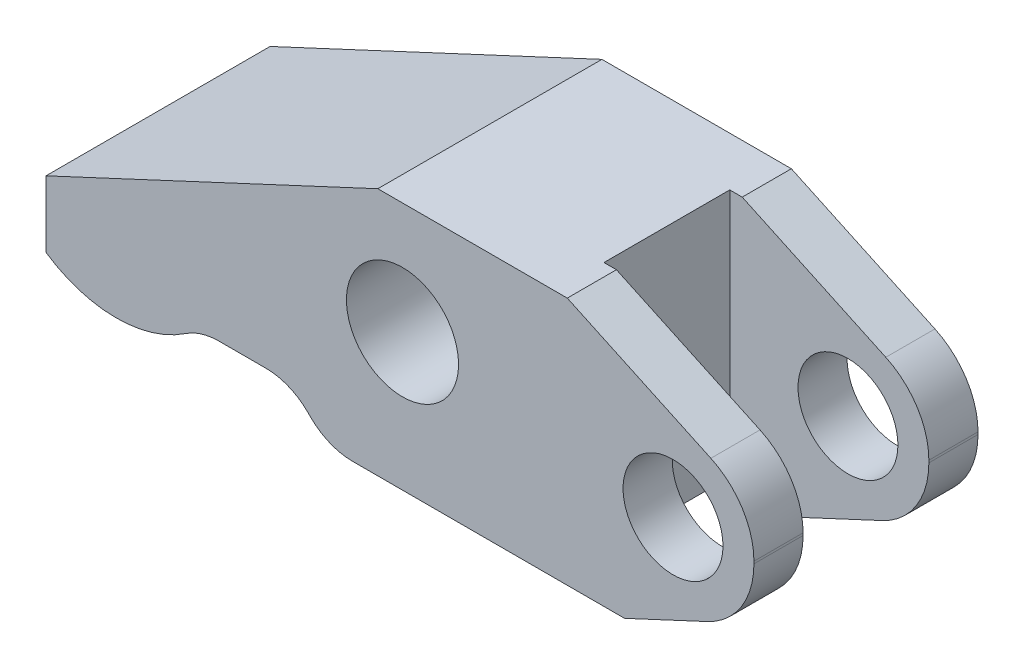
ISO-10303-21;
HEADER;
FILE_DESCRIPTION(('STEP AP214'),'2;1');
FILE_NAME('part.step','',(''),(''),'','','');
FILE_SCHEMA(('AUTOMOTIVE_DESIGN { 1 0 10303 214 1 1 1 1 }'));
ENDSEC;
DATA;
#1=APPLICATION_CONTEXT('core data for automotive mechanical design processes');
#2=APPLICATION_PROTOCOL_DEFINITION('international standard','automotive_design',2000,#1);
#3=PRODUCT_CONTEXT('',#1,'mechanical');
#4=PRODUCT('Part','Part','',(#3));
#5=PRODUCT_RELATED_PRODUCT_CATEGORY('part','',(#4));
#6=PRODUCT_DEFINITION_FORMATION('','',#4);
#7=PRODUCT_DEFINITION_CONTEXT('part definition',#1,'design');
#8=PRODUCT_DEFINITION('design','',#6,#7);
#9=PRODUCT_DEFINITION_SHAPE('','',#8);
#10=(LENGTH_UNIT() NAMED_UNIT(*) SI_UNIT(.MILLI.,.METRE.));
#11=(NAMED_UNIT(*) PLANE_ANGLE_UNIT() SI_UNIT($,.RADIAN.));
#12=(NAMED_UNIT(*) SI_UNIT($,.STERADIAN.) SOLID_ANGLE_UNIT());
#13=UNCERTAINTY_MEASURE_WITH_UNIT(LENGTH_MEASURE(1.E-05),#10,'distance_accuracy_value','');
#14=(GEOMETRIC_REPRESENTATION_CONTEXT(3) GLOBAL_UNCERTAINTY_ASSIGNED_CONTEXT((#13)) GLOBAL_UNIT_ASSIGNED_CONTEXT((#10,
#11,#12)) REPRESENTATION_CONTEXT('',''));
#15=CARTESIAN_POINT('',(0.,0.,0.));
#16=DIRECTION('',(0.,0.,1.));
#17=DIRECTION('',(1.,0.,0.));
#18=AXIS2_PLACEMENT_3D('',#15,#16,#17);
#19=CARTESIAN_POINT('',(28.448,9.9949,-9.0043));
#20=DIRECTION('',(-1.,0.,0.));
#21=DIRECTION('',(0.,0.,1.));
#22=AXIS2_PLACEMENT_3D('',#19,#20,#21);
#23=PLANE('',#22);
#24=DIRECTION('',(0.,0.,1.));
#25=VECTOR('',#24,1.);
#26=CARTESIAN_POINT('',(28.448,-1.0033,-9.0043));
#27=LINE('',#26,#25);
#28=CARTESIAN_POINT('',(28.448,-1.0033,5.0546));
#29=VERTEX_POINT('',#28);
#30=CARTESIAN_POINT('',(28.448,-1.0033,9.0043));
#31=VERTEX_POINT('',#30);
#32=EDGE_CURVE('E313',#29,#31,#27,.T.);
#33=ORIENTED_EDGE('',*,*,#32,.F.);
#34=DIRECTION('',(0.,1.,0.));
#35=VECTOR('',#34,1.);
#36=CARTESIAN_POINT('',(28.448,-9.9949,5.0546));
#37=LINE('',#36,#35);
#38=CARTESIAN_POINT('',(28.448,-0.818554854479687,5.0546));
#39=VERTEX_POINT('',#38);
#40=EDGE_CURVE('E224',#29,#39,#37,.T.);
#41=ORIENTED_EDGE('',*,*,#40,.T.);
#42=DIRECTION('',(0.,0.,1.));
#43=VECTOR('',#42,1.);
#44=CARTESIAN_POINT('',(28.448,-0.818554854479686,-9.0043));
#45=LINE('',#44,#43);
#46=CARTESIAN_POINT('',(28.448,-0.818554854479686,9.0043));
#47=VERTEX_POINT('',#46);
#48=EDGE_CURVE('E309',#39,#47,#45,.T.);
#49=ORIENTED_EDGE('',*,*,#48,.T.);
#50=DIRECTION('',(0.,-1.,0.));
#51=VECTOR('',#50,1.);
#52=CARTESIAN_POINT('',(28.448,9.9949,9.0043));
#53=LINE('',#52,#51);
#54=EDGE_CURVE('E349',#47,#31,#53,.T.);
#55=ORIENTED_EDGE('',*,*,#54,.T.);
#56=EDGE_LOOP('',(#33,#41,#49,#55));
#57=FACE_BOUND('',#56,.T.);
#58=ADVANCED_FACE('F35',(#57),#23,.F.);
#59=CARTESIAN_POINT('',(21.9456,-1.0033,-9.0043));
#60=DIRECTION('',(0.,0.,1.));
#61=DIRECTION('',(1.,0.,0.));
#62=AXIS2_PLACEMENT_3D('',#59,#60,#61);
#63=CYLINDRICAL_SURFACE('',#62,4.01574);
#64=CARTESIAN_POINT('',(21.9456,-1.0033,5.0546));
#65=DIRECTION('',(0.,0.,1.));
#66=DIRECTION('',(1.,0.,0.));
#67=AXIS2_PLACEMENT_3D('',#64,#65,#66);
#68=CIRCLE('',#67,4.01574);
#69=CARTESIAN_POINT('',(25.96134,-1.0033,5.0546));
#70=VERTEX_POINT('',#69);
#71=EDGE_CURVE('E243',#70,#70,#68,.F.);
#72=ORIENTED_EDGE('',*,*,#71,.T.);
#73=EDGE_LOOP('',(#72));
#74=FACE_BOUND('',#73,.T.);
#75=CARTESIAN_POINT('',(21.9456,-1.0033,9.0043));
#76=DIRECTION('',(0.,0.,1.));
#77=DIRECTION('',(1.,0.,0.));
#78=AXIS2_PLACEMENT_3D('',#75,#76,#77);
#79=CIRCLE('',#78,4.01574);
#80=CARTESIAN_POINT('',(25.96134,-1.0033,9.0043));
#81=VERTEX_POINT('',#80);
#82=EDGE_CURVE('E326',#81,#81,#79,.T.);
#83=ORIENTED_EDGE('',*,*,#82,.T.);
#84=EDGE_LOOP('',(#83));
#85=FACE_BOUND('',#84,.T.);
#86=ADVANCED_FACE('F476',(#74,#85),#63,.F.);
#87=CARTESIAN_POINT('',(18.0490407478371,-9.9949,-9.0043));
#88=DIRECTION('',(0.422618261740701,-0.906307787036649,0.));
#89=DIRECTION('',(0.906307787036649,0.422618261740701,0.));
#90=AXIS2_PLACEMENT_3D('',#87,#88,#89);
#91=PLANE('',#90);
#92=DIRECTION('',(-0.906307787036649,-0.422618261740701,0.));
#93=VECTOR('',#92,1.);
#94=CARTESIAN_POINT('',(18.0490407478371,-9.9949,5.0546));
#95=LINE('',#94,#93);
#96=CARTESIAN_POINT('',(24.6936329851427,-6.89647575442711,5.0546));
#97=VERTEX_POINT('',#96);
#98=CARTESIAN_POINT('',(18.0490407478371,-9.9949,5.0546));
#99=VERTEX_POINT('',#98);
#100=EDGE_CURVE('E241',#97,#99,#95,.T.);
#101=ORIENTED_EDGE('',*,*,#100,.F.);
#102=DIRECTION('',(0.,0.,1.));
#103=VECTOR('',#102,1.);
#104=CARTESIAN_POINT('',(24.6936329851427,-6.89647575442711,-9.0043));
#105=LINE('',#104,#103);
#106=CARTESIAN_POINT('',(24.6936329851427,-6.89647575442711,9.0043));
#107=VERTEX_POINT('',#106);
#108=EDGE_CURVE('E317',#97,#107,#105,.T.);
#109=ORIENTED_EDGE('',*,*,#108,.T.);
#110=DIRECTION('',(0.906307787036649,0.422618261740701,0.));
#111=VECTOR('',#110,1.);
#112=CARTESIAN_POINT('',(18.0490407478371,-9.9949,9.0043));
#113=LINE('',#112,#111);
#114=CARTESIAN_POINT('',(18.0490407478371,-9.9949,9.0043));
#115=VERTEX_POINT('',#114);
#116=EDGE_CURVE('E265',#115,#107,#113,.T.);
#117=ORIENTED_EDGE('',*,*,#116,.F.);
#118=DIRECTION('',(0.,0.,1.));
#119=VECTOR('',#118,1.);
#120=CARTESIAN_POINT('',(18.0490407478371,-9.9949,-9.0043));
#121=LINE('',#120,#119);
#122=EDGE_CURVE('E292',#99,#115,#121,.T.);
#123=ORIENTED_EDGE('',*,*,#122,.F.);
#124=EDGE_LOOP('',(#101,#109,#117,#123));
#125=FACE_BOUND('',#124,.T.);
#126=ADVANCED_FACE('F421',(#125),#91,.T.);
#127=CARTESIAN_POINT('',(21.9456,-1.0033,-9.0043));
#128=DIRECTION('',(0.,0.,1.));
#129=DIRECTION('',(1.,0.,0.));
#130=AXIS2_PLACEMENT_3D('',#127,#128,#129);
#131=CYLINDRICAL_SURFACE('',#130,6.5024);
#132=CARTESIAN_POINT('',(21.9456,-1.0033,5.0546));
#133=DIRECTION('',(0.,0.,1.));
#134=DIRECTION('',(1.,0.,0.));
#135=AXIS2_PLACEMENT_3D('',#132,#133,#134);
#136=CIRCLE('',#135,6.5024);
#137=EDGE_CURVE('E239',#29,#97,#136,.F.);
#138=ORIENTED_EDGE('',*,*,#137,.F.);
#139=ORIENTED_EDGE('',*,*,#32,.T.);
#140=CARTESIAN_POINT('',(21.9456,-1.0033,9.0043));
#141=DIRECTION('',(0.,0.,1.));
#142=DIRECTION('',(-1.,0.,0.));
#143=AXIS2_PLACEMENT_3D('',#140,#141,#142);
#144=CIRCLE('',#143,6.5024);
#145=EDGE_CURVE('E268',#107,#31,#144,.T.);
#146=ORIENTED_EDGE('',*,*,#145,.F.);
#147=ORIENTED_EDGE('',*,*,#108,.F.);
#148=EDGE_LOOP('',(#138,#139,#146,#147));
#149=FACE_BOUND('',#148,.T.);
#150=ADVANCED_FACE('F417',(#149),#131,.T.);
#151=CARTESIAN_POINT('',(24.9869429081785,4.61421654413281,-9.0043));
#152=DIRECTION('',(0.4226182617407,0.90630778703665,0.));
#153=DIRECTION('',(-0.90630778703665,0.4226182617407,0.));
#154=AXIS2_PLACEMENT_3D('',#151,#152,#153);
#155=PLANE('',#154);
#156=DIRECTION('',(0.90630778703665,-0.4226182617407,0.));
#157=VECTOR('',#156,1.);
#158=CARTESIAN_POINT('',(24.9869429081785,4.61421654413281,5.0546));
#159=LINE('',#158,#157);
#160=CARTESIAN_POINT('',(13.44803,9.9949,5.0546));
#161=VERTEX_POINT('',#160);
#162=CARTESIAN_POINT('',(24.9869429081785,4.6142165441328,5.0546));
#163=VERTEX_POINT('',#162);
#164=EDGE_CURVE('E237',#161,#163,#159,.T.);
#165=ORIENTED_EDGE('',*,*,#164,.F.);
#166=DIRECTION('',(0.,0.,1.));
#167=VECTOR('',#166,1.);
#168=CARTESIAN_POINT('',(13.44803,9.9949,-9.0043));
#169=LINE('',#168,#167);
#170=CARTESIAN_POINT('',(13.44803,9.9949,9.0043));
#171=VERTEX_POINT('',#170);
#172=EDGE_CURVE('E301',#161,#171,#169,.T.);
#173=ORIENTED_EDGE('',*,*,#172,.T.);
#174=DIRECTION('',(-0.90630778703665,0.4226182617407,0.));
#175=VECTOR('',#174,1.);
#176=CARTESIAN_POINT('',(24.9869429081785,4.61421654413281,9.0043));
#177=LINE('',#176,#175);
#178=CARTESIAN_POINT('',(24.9869429081785,4.6142165441328,9.0043));
#179=VERTEX_POINT('',#178);
#180=EDGE_CURVE('E274',#179,#171,#177,.T.);
#181=ORIENTED_EDGE('',*,*,#180,.F.);
#182=DIRECTION('',(0.,0.,1.));
#183=VECTOR('',#182,1.);
#184=CARTESIAN_POINT('',(24.9869429081785,4.6142165441328,-9.0043));
#185=LINE('',#184,#183);
#186=EDGE_CURVE('E305',#163,#179,#185,.T.);
#187=ORIENTED_EDGE('',*,*,#186,.F.);
#188=EDGE_LOOP('',(#165,#173,#181,#187));
#189=FACE_BOUND('',#188,.T.);
#190=ADVANCED_FACE('F403',(#189),#155,.T.);
#191=CARTESIAN_POINT('',(22.4536,-0.818554854479687,-9.0043));
#192=DIRECTION('',(0.,0.,1.));
#193=DIRECTION('',(1.,0.,0.));
#194=AXIS2_PLACEMENT_3D('',#191,#192,#193);
#195=CYLINDRICAL_SURFACE('',#194,5.9944);
#196=CARTESIAN_POINT('',(22.4536,-0.818554854479687,5.0546));
#197=DIRECTION('',(0.,0.,1.));
#198=DIRECTION('',(1.,0.,0.));
#199=AXIS2_PLACEMENT_3D('',#196,#197,#198);
#200=CIRCLE('',#199,5.9944);
#201=EDGE_CURVE('E12',#163,#39,#200,.F.);
#202=ORIENTED_EDGE('',*,*,#201,.F.);
#203=ORIENTED_EDGE('',*,*,#186,.T.);
#204=CARTESIAN_POINT('',(22.4536,-0.818554854479687,9.0043));
#205=DIRECTION('',(0.,0.,1.));
#206=DIRECTION('',(1.,0.,0.));
#207=AXIS2_PLACEMENT_3D('',#204,#205,#206);
#208=CIRCLE('',#207,5.9944);
#209=EDGE_CURVE('E271',#47,#179,#208,.T.);
#210=ORIENTED_EDGE('',*,*,#209,.F.);
#211=ORIENTED_EDGE('',*,*,#48,.F.);
#212=EDGE_LOOP('',(#202,#203,#210,#211));
#213=FACE_BOUND('',#212,.T.);
#214=ADVANCED_FACE('F410',(#213),#195,.T.);
#215=CARTESIAN_POINT('',(-28.448,9.9949,-9.0043));
#216=DIRECTION('',(1.,0.,0.));
#217=DIRECTION('',(0.,0.,-1.));
#218=AXIS2_PLACEMENT_3D('',#215,#216,#217);
#219=PLANE('',#218);
#220=DIRECTION('',(0.,-1.,0.));
#221=VECTOR('',#220,1.);
#222=CARTESIAN_POINT('',(-28.448,9.9949,-9.0043));
#223=LINE('',#222,#221);
#224=CARTESIAN_POINT('',(-28.448,-2.44152524299387,-9.0043));
#225=VERTEX_POINT('',#224);
#226=CARTESIAN_POINT('',(-28.448,-7.77246827928795,-9.0043));
#227=VERTEX_POINT('',#226);
#228=EDGE_CURVE('E340',#225,#227,#223,.T.);
#229=ORIENTED_EDGE('',*,*,#228,.T.);
#230=DIRECTION('',(0.,0.,1.));
#231=VECTOR('',#230,1.);
#232=CARTESIAN_POINT('',(-28.448,-7.77246827928795,-9.0043));
#233=LINE('',#232,#231);
#234=CARTESIAN_POINT('',(-28.448,-7.77246827928795,9.0043));
#235=VERTEX_POINT('',#234);
#236=EDGE_CURVE('E262',#227,#235,#233,.T.);
#237=ORIENTED_EDGE('',*,*,#236,.T.);
#238=DIRECTION('',(0.,-1.,0.));
#239=VECTOR('',#238,1.);
#240=CARTESIAN_POINT('',(-28.448,9.9949,9.0043));
#241=LINE('',#240,#239);
#242=CARTESIAN_POINT('',(-28.448,-2.44152524299387,9.0043));
#243=VERTEX_POINT('',#242);
#244=EDGE_CURVE('E352',#243,#235,#241,.T.);
#245=ORIENTED_EDGE('',*,*,#244,.F.);
#246=DIRECTION('',(0.,0.,1.));
#247=VECTOR('',#246,1.);
#248=CARTESIAN_POINT('',(-28.448,-2.44152524299387,-9.0043));
#249=LINE('',#248,#247);
#250=EDGE_CURVE('E293',#225,#243,#249,.T.);
#251=ORIENTED_EDGE('',*,*,#250,.F.);
#252=EDGE_LOOP('',(#229,#237,#245,#251));
#253=FACE_BOUND('',#252,.T.);
#254=ADVANCED_FACE('F463',(#253),#219,.F.);
#255=CARTESIAN_POINT('',(-28.448,9.9949,9.0043));
#256=DIRECTION('',(0.,0.,-1.));
#257=DIRECTION('',(-1.,0.,0.));
#258=AXIS2_PLACEMENT_3D('',#255,#256,#257);
#259=PLANE('',#258);
#260=ORIENTED_EDGE('',*,*,#82,.F.);
#261=EDGE_LOOP('',(#260));
#262=FACE_BOUND('',#261,.T.);
#263=CARTESIAN_POINT('',(0.203200000000004,1.0033,9.0043));
#264=DIRECTION('',(0.,0.,1.));
#265=DIRECTION('',(1.,0.,0.));
#266=AXIS2_PLACEMENT_3D('',#263,#264,#265);
#267=CIRCLE('',#266,4.50596);
#268=CARTESIAN_POINT('',(4.70916000000001,1.0033,9.0043));
#269=VERTEX_POINT('',#268);
#270=EDGE_CURVE('E295',#269,#269,#267,.T.);
#271=ORIENTED_EDGE('',*,*,#270,.F.);
#272=EDGE_LOOP('',(#271));
#273=FACE_BOUND('',#272,.T.);
#274=DIRECTION('',(-0.707106781186551,0.707106781186544,0.));
#275=VECTOR('',#274,1.);
#276=CARTESIAN_POINT('',(-5.79119999999996,-9.9949,9.0043));
#277=LINE('',#276,#275);
#278=CARTESIAN_POINT('',(-7.18982369847796,-8.59627630152202,9.0043));
#279=VERTEX_POINT('',#278);
#280=CARTESIAN_POINT('',(-7.389776301522,-8.39632369847798,9.0043));
#281=VERTEX_POINT('',#280);
#282=EDGE_CURVE('E251',#279,#281,#277,.T.);
#283=ORIENTED_EDGE('',*,*,#282,.F.);
#284=CARTESIAN_POINT('',(-3.81324739695597,-5.2197,9.0043));
#285=DIRECTION('',(0.,0.,-1.));
#286=DIRECTION('',(-1.,0.,0.));
#287=AXIS2_PLACEMENT_3D('',#284,#285,#286);
#288=CIRCLE('',#287,4.7752);
#289=CARTESIAN_POINT('',(-3.81324739695597,-9.9949,9.0043));
#290=VERTEX_POINT('',#289);
#291=EDGE_CURVE('E368',#279,#290,#288,.F.);
#292=ORIENTED_EDGE('',*,*,#291,.T.);
#293=DIRECTION('',(1.,0.,0.));
#294=VECTOR('',#293,1.);
#295=CARTESIAN_POINT('',(-28.448,-9.9949,9.0043));
#296=LINE('',#295,#294);
#297=EDGE_CURVE('E332',#290,#115,#296,.T.);
#298=ORIENTED_EDGE('',*,*,#297,.T.);
#299=ORIENTED_EDGE('',*,*,#116,.T.);
#300=ORIENTED_EDGE('',*,*,#145,.T.);
#301=ORIENTED_EDGE('',*,*,#54,.F.);
#302=ORIENTED_EDGE('',*,*,#209,.T.);
#303=ORIENTED_EDGE('',*,*,#180,.T.);
#304=DIRECTION('',(1.,0.,0.));
#305=VECTOR('',#304,1.);
#306=CARTESIAN_POINT('',(-28.448,9.9949,9.0043));
#307=LINE('',#306,#305);
#308=CARTESIAN_POINT('',(-1.778,9.9949,9.0043));
#309=VERTEX_POINT('',#308);
#310=EDGE_CURVE('E333',#309,#171,#307,.T.);
#311=ORIENTED_EDGE('',*,*,#310,.F.);
#312=DIRECTION('',(-0.906307787036649,-0.422618261740701,0.));
#313=VECTOR('',#312,1.);
#314=CARTESIAN_POINT('',(-1.778,9.9949,9.0043));
#315=LINE('',#314,#313);
#316=EDGE_CURVE('E277',#309,#243,#315,.T.);
#317=ORIENTED_EDGE('',*,*,#316,.T.);
#318=ORIENTED_EDGE('',*,*,#244,.T.);
#319=CARTESIAN_POINT('',(-22.8092,0.495299999999994,9.0043));
#320=DIRECTION('',(0.,0.,-1.));
#321=DIRECTION('',(1.,0.,0.));
#322=AXIS2_PLACEMENT_3D('',#319,#320,#321);
#323=CIRCLE('',#322,10.0076);
#324=CARTESIAN_POINT('',(-17.2257921222764,-7.8099762886598,9.0043));
#325=VERTEX_POINT('',#324);
#326=EDGE_CURVE('E249',#325,#235,#323,.T.);
#327=ORIENTED_EDGE('',*,*,#326,.F.);
#328=CARTESIAN_POINT('',(-14.5616279572713,-11.7729,9.0043));
#329=DIRECTION('',(0.,0.,-1.));
#330=DIRECTION('',(-1.,0.,0.));
#331=AXIS2_PLACEMENT_3D('',#328,#329,#330);
#332=CIRCLE('',#331,4.7752);
#333=CARTESIAN_POINT('',(-14.5616279572713,-6.9977,9.0043));
#334=VERTEX_POINT('',#333);
#335=EDGE_CURVE('E373',#325,#334,#332,.T.);
#336=ORIENTED_EDGE('',*,*,#335,.T.);
#337=DIRECTION('',(-1.,0.,0.));
#338=VECTOR('',#337,1.);
#339=CARTESIAN_POINT('',(-8.78839999999999,-6.9977,9.0043));
#340=LINE('',#339,#338);
#341=CARTESIAN_POINT('',(-10.766352603044,-6.9977,9.0043));
#342=VERTEX_POINT('',#341);
#343=EDGE_CURVE('E246',#342,#334,#340,.T.);
#344=ORIENTED_EDGE('',*,*,#343,.F.);
#345=CARTESIAN_POINT('',(-10.766352603044,-11.7729,9.0043));
#346=DIRECTION('',(0.,0.,-1.));
#347=DIRECTION('',(-1.,0.,0.));
#348=AXIS2_PLACEMENT_3D('',#345,#346,#347);
#349=CIRCLE('',#348,4.7752);
#350=EDGE_CURVE('E377',#342,#281,#349,.T.);
#351=ORIENTED_EDGE('',*,*,#350,.T.);
#352=EDGE_LOOP('',(#283,#292,#298,#299,#300,#301,#302,#303,#311,#317,#318,#327,#336,#344,#351));
#353=FACE_BOUND('',#352,.T.);
#354=ADVANCED_FACE('F395',(#262,#273,#353),#259,.F.);
#355=CARTESIAN_POINT('',(28.448,-0.818554854479686,-9.0043));
#356=VERTEX_POINT('',#355);
#357=CARTESIAN_POINT('',(28.448,-0.818554854479686,-5.0546));
#358=VERTEX_POINT('',#357);
#359=EDGE_CURVE('E306',#356,#358,#45,.T.);
#360=ORIENTED_EDGE('',*,*,#359,.T.);
#361=DIRECTION('',(0.,1.,0.));
#362=VECTOR('',#361,1.);
#363=CARTESIAN_POINT('',(28.448,-9.9949,-5.0546));
#364=LINE('',#363,#362);
#365=CARTESIAN_POINT('',(28.448,-1.0033,-5.0546));
#366=VERTEX_POINT('',#365);
#367=EDGE_CURVE('E50',#366,#358,#364,.T.);
#368=ORIENTED_EDGE('',*,*,#367,.F.);
#369=CARTESIAN_POINT('',(28.448,-1.0033,-9.0043));
#370=VERTEX_POINT('',#369);
#371=EDGE_CURVE('E310',#370,#366,#27,.T.);
#372=ORIENTED_EDGE('',*,*,#371,.F.);
#373=DIRECTION('',(0.,-1.,0.));
#374=VECTOR('',#373,1.);
#375=CARTESIAN_POINT('',(28.448,9.9949,-9.0043));
#376=LINE('',#375,#374);
#377=EDGE_CURVE('E346',#356,#370,#376,.T.);
#378=ORIENTED_EDGE('',*,*,#377,.F.);
#379=EDGE_LOOP('',(#360,#368,#372,#378));
#380=FACE_BOUND('',#379,.T.);
#381=ADVANCED_FACE('F435',(#380),#23,.F.);
#382=CARTESIAN_POINT('',(-28.448,9.9949,-9.0043));
#383=DIRECTION('',(0.,0.,1.));
#384=DIRECTION('',(1.,0.,0.));
#385=AXIS2_PLACEMENT_3D('',#382,#383,#384);
#386=PLANE('',#385);
#387=CARTESIAN_POINT('',(21.9456,-1.0033,-9.0043));
#388=DIRECTION('',(0.,0.,1.));
#389=DIRECTION('',(1.,0.,0.));
#390=AXIS2_PLACEMENT_3D('',#387,#388,#389);
#391=CIRCLE('',#390,4.01574);
#392=CARTESIAN_POINT('',(25.96134,-1.0033,-9.0043));
#393=VERTEX_POINT('',#392);
#394=EDGE_CURVE('E329',#393,#393,#391,.T.);
#395=ORIENTED_EDGE('',*,*,#394,.T.);
#396=EDGE_LOOP('',(#395));
#397=FACE_BOUND('',#396,.T.);
#398=CARTESIAN_POINT('',(0.203200000000004,1.0033,-9.0043));
#399=DIRECTION('',(0.,0.,1.));
#400=DIRECTION('',(1.,0.,0.));
#401=AXIS2_PLACEMENT_3D('',#398,#399,#400);
#402=CIRCLE('',#401,4.50596);
#403=CARTESIAN_POINT('',(4.70916000000001,1.0033,-9.0043));
#404=VERTEX_POINT('',#403);
#405=EDGE_CURVE('E323',#404,#404,#402,.T.);
#406=ORIENTED_EDGE('',*,*,#405,.T.);
#407=EDGE_LOOP('',(#406));
#408=FACE_BOUND('',#407,.T.);
#409=DIRECTION('',(-1.,0.,0.));
#410=VECTOR('',#409,1.);
#411=CARTESIAN_POINT('',(-28.448,-9.9949,-9.0043));
#412=LINE('',#411,#410);
#413=CARTESIAN_POINT('',(18.0490407478371,-9.9949,-9.0043));
#414=VERTEX_POINT('',#413);
#415=CARTESIAN_POINT('',(-3.81324739695597,-9.9949,-9.0043));
#416=VERTEX_POINT('',#415);
#417=EDGE_CURVE('E337',#414,#416,#412,.T.);
#418=ORIENTED_EDGE('',*,*,#417,.T.);
#419=CARTESIAN_POINT('',(-3.81324739695597,-5.2197,-9.0043));
#420=DIRECTION('',(0.,0.,1.));
#421=DIRECTION('',(1.,0.,0.));
#422=AXIS2_PLACEMENT_3D('',#419,#420,#421);
#423=CIRCLE('',#422,4.7752);
#424=CARTESIAN_POINT('',(-7.18982369847796,-8.59627630152202,-9.0043));
#425=VERTEX_POINT('',#424);
#426=EDGE_CURVE('E371',#416,#425,#423,.F.);
#427=ORIENTED_EDGE('',*,*,#426,.T.);
#428=DIRECTION('',(-0.707106781186551,0.707106781186544,0.));
#429=VECTOR('',#428,1.);
#430=CARTESIAN_POINT('',(-5.79119999999996,-9.9949,-9.0043));
#431=LINE('',#430,#429);
#432=CARTESIAN_POINT('',(-7.389776301522,-8.39632369847798,-9.0043));
#433=VERTEX_POINT('',#432);
#434=EDGE_CURVE('E259',#425,#433,#431,.T.);
#435=ORIENTED_EDGE('',*,*,#434,.T.);
#436=CARTESIAN_POINT('',(-10.766352603044,-11.7729,-9.0043));
#437=DIRECTION('',(0.,0.,1.));
#438=DIRECTION('',(1.,0.,0.));
#439=AXIS2_PLACEMENT_3D('',#436,#437,#438);
#440=CIRCLE('',#439,4.7752);
#441=CARTESIAN_POINT('',(-10.766352603044,-6.9977,-9.0043));
#442=VERTEX_POINT('',#441);
#443=EDGE_CURVE('E379',#433,#442,#440,.T.);
#444=ORIENTED_EDGE('',*,*,#443,.T.);
#445=DIRECTION('',(-1.,0.,0.));
#446=VECTOR('',#445,1.);
#447=CARTESIAN_POINT('',(-8.78839999999999,-6.9977,-9.0043));
#448=LINE('',#447,#446);
#449=CARTESIAN_POINT('',(-14.5616279572713,-6.9977,-9.0043));
#450=VERTEX_POINT('',#449);
#451=EDGE_CURVE('E254',#442,#450,#448,.T.);
#452=ORIENTED_EDGE('',*,*,#451,.T.);
#453=CARTESIAN_POINT('',(-14.5616279572713,-11.7729,-9.0043));
#454=DIRECTION('',(0.,0.,1.));
#455=DIRECTION('',(1.,0.,0.));
#456=AXIS2_PLACEMENT_3D('',#453,#454,#455);
#457=CIRCLE('',#456,4.7752);
#458=CARTESIAN_POINT('',(-17.2257921222764,-7.8099762886598,-9.0043));
#459=VERTEX_POINT('',#458);
#460=EDGE_CURVE('E375',#450,#459,#457,.T.);
#461=ORIENTED_EDGE('',*,*,#460,.T.);
#462=CARTESIAN_POINT('',(-22.8092,0.495299999999994,-9.0043));
#463=DIRECTION('',(0.,0.,-1.));
#464=DIRECTION('',(1.,0.,0.));
#465=AXIS2_PLACEMENT_3D('',#462,#463,#464);
#466=CIRCLE('',#465,10.0076);
#467=EDGE_CURVE('E257',#459,#227,#466,.T.);
#468=ORIENTED_EDGE('',*,*,#467,.T.);
#469=ORIENTED_EDGE('',*,*,#228,.F.);
#470=DIRECTION('',(-0.906307787036649,-0.422618261740701,0.));
#471=VECTOR('',#470,1.);
#472=CARTESIAN_POINT('',(-1.778,9.9949,-9.0043));
#473=LINE('',#472,#471);
#474=CARTESIAN_POINT('',(-1.778,9.9949,-9.0043));
#475=VERTEX_POINT('',#474);
#476=EDGE_CURVE('E290',#475,#225,#473,.T.);
#477=ORIENTED_EDGE('',*,*,#476,.F.);
#478=DIRECTION('',(-1.,0.,0.));
#479=VECTOR('',#478,1.);
#480=CARTESIAN_POINT('',(-28.448,9.9949,-9.0043));
#481=LINE('',#480,#479);
#482=CARTESIAN_POINT('',(13.44803,9.9949,-9.0043));
#483=VERTEX_POINT('',#482);
#484=EDGE_CURVE('E336',#483,#475,#481,.T.);
#485=ORIENTED_EDGE('',*,*,#484,.F.);
#486=DIRECTION('',(-0.90630778703665,0.4226182617407,0.));
#487=VECTOR('',#486,1.);
#488=CARTESIAN_POINT('',(24.9869429081785,4.61421654413281,-9.0043));
#489=LINE('',#488,#487);
#490=CARTESIAN_POINT('',(24.9869429081785,4.6142165441328,-9.0043));
#491=VERTEX_POINT('',#490);
#492=EDGE_CURVE('E288',#491,#483,#489,.T.);
#493=ORIENTED_EDGE('',*,*,#492,.F.);
#494=CARTESIAN_POINT('',(22.4536,-0.818554854479687,-9.0043));
#495=DIRECTION('',(0.,0.,1.));
#496=DIRECTION('',(1.,0.,0.));
#497=AXIS2_PLACEMENT_3D('',#494,#495,#496);
#498=CIRCLE('',#497,5.9944);
#499=EDGE_CURVE('E285',#356,#491,#498,.T.);
#500=ORIENTED_EDGE('',*,*,#499,.F.);
#501=ORIENTED_EDGE('',*,*,#377,.T.);
#502=CARTESIAN_POINT('',(21.9456,-1.0033,-9.0043));
#503=DIRECTION('',(0.,0.,1.));
#504=DIRECTION('',(-1.,0.,0.));
#505=AXIS2_PLACEMENT_3D('',#502,#503,#504);
#506=CIRCLE('',#505,6.5024);
#507=CARTESIAN_POINT('',(24.6936329851427,-6.8964757544271,-9.0043));
#508=VERTEX_POINT('',#507);
#509=EDGE_CURVE('E283',#508,#370,#506,.T.);
#510=ORIENTED_EDGE('',*,*,#509,.F.);
#511=DIRECTION('',(0.906307787036649,0.422618261740701,0.));
#512=VECTOR('',#511,1.);
#513=CARTESIAN_POINT('',(18.0490407478371,-9.9949,-9.0043));
#514=LINE('',#513,#512);
#515=EDGE_CURVE('E280',#414,#508,#514,.T.);
#516=ORIENTED_EDGE('',*,*,#515,.F.);
#517=EDGE_LOOP('',(#418,#427,#435,#444,#452,#461,#468,#469,#477,#485,#493,#500,#501,#510,#516));
#518=FACE_BOUND('',#517,.T.);
#519=ADVANCED_FACE('F389',(#397,#408,#518),#386,.F.);
#520=CARTESIAN_POINT('',(0.,9.9949,0.));
#521=DIRECTION('',(0.,1.,0.));
#522=DIRECTION('',(0.,0.,1.));
#523=AXIS2_PLACEMENT_3D('',#520,#521,#522);
#524=PLANE('',#523);
#525=DIRECTION('',(1.,0.,0.));
#526=VECTOR('',#525,1.);
#527=CARTESIAN_POINT('',(28.448,9.9949,5.0546));
#528=LINE('',#527,#526);
#529=CARTESIAN_POINT('',(12.446,9.9949,5.0546));
#530=VERTEX_POINT('',#529);
#531=EDGE_CURVE('E214',#530,#161,#528,.T.);
#532=ORIENTED_EDGE('',*,*,#531,.F.);
#533=DIRECTION('',(0.,0.,1.));
#534=VECTOR('',#533,1.);
#535=CARTESIAN_POINT('',(12.446,9.9949,-5.0546));
#536=LINE('',#535,#534);
#537=CARTESIAN_POINT('',(12.446,9.9949,-5.0546));
#538=VERTEX_POINT('',#537);
#539=EDGE_CURVE('E201',#538,#530,#536,.T.);
#540=ORIENTED_EDGE('',*,*,#539,.F.);
#541=DIRECTION('',(-1.,0.,0.));
#542=VECTOR('',#541,1.);
#543=CARTESIAN_POINT('',(28.448,9.9949,-5.0546));
#544=LINE('',#543,#542);
#545=CARTESIAN_POINT('',(13.44803,9.9949,-5.0546));
#546=VERTEX_POINT('',#545);
#547=EDGE_CURVE('E189',#546,#538,#544,.T.);
#548=ORIENTED_EDGE('',*,*,#547,.F.);
#549=EDGE_CURVE('E299',#483,#546,#169,.T.);
#550=ORIENTED_EDGE('',*,*,#549,.F.);
#551=ORIENTED_EDGE('',*,*,#484,.T.);
#552=DIRECTION('',(0.,0.,1.));
#553=VECTOR('',#552,1.);
#554=CARTESIAN_POINT('',(-1.778,9.9949,-9.0043));
#555=LINE('',#554,#553);
#556=EDGE_CURVE('E296',#475,#309,#555,.T.);
#557=ORIENTED_EDGE('',*,*,#556,.T.);
#558=ORIENTED_EDGE('',*,*,#310,.T.);
#559=ORIENTED_EDGE('',*,*,#172,.F.);
#560=EDGE_LOOP('',(#532,#540,#548,#550,#551,#557,#558,#559));
#561=FACE_BOUND('',#560,.T.);
#562=ADVANCED_FACE('F212',(#561),#524,.T.);
#563=CARTESIAN_POINT('',(0.,-9.9949,0.));
#564=DIRECTION('',(0.,1.,0.));
#565=DIRECTION('',(0.,0.,1.));
#566=AXIS2_PLACEMENT_3D('',#563,#564,#565);
#567=PLANE('',#566);
#568=DIRECTION('',(0.,0.,1.));
#569=VECTOR('',#568,1.);
#570=CARTESIAN_POINT('',(12.446,-9.9949,-5.0546));
#571=LINE('',#570,#569);
#572=CARTESIAN_POINT('',(12.446,-9.9949,-5.0546));
#573=VERTEX_POINT('',#572);
#574=CARTESIAN_POINT('',(12.446,-9.9949,5.0546));
#575=VERTEX_POINT('',#574);
#576=EDGE_CURVE('E208',#573,#575,#571,.T.);
#577=ORIENTED_EDGE('',*,*,#576,.T.);
#578=DIRECTION('',(1.,0.,0.));
#579=VECTOR('',#578,1.);
#580=CARTESIAN_POINT('',(28.448,-9.9949,5.0546));
#581=LINE('',#580,#579);
#582=EDGE_CURVE('E221',#575,#99,#581,.T.);
#583=ORIENTED_EDGE('',*,*,#582,.T.);
#584=ORIENTED_EDGE('',*,*,#122,.T.);
#585=ORIENTED_EDGE('',*,*,#297,.F.);
#586=DIRECTION('',(0.,0.,1.));
#587=VECTOR('',#586,1.);
#588=CARTESIAN_POINT('',(-3.81324739695597,-9.9949,0.));
#589=LINE('',#588,#587);
#590=EDGE_CURVE('E58',#290,#416,#589,.F.);
#591=ORIENTED_EDGE('',*,*,#590,.T.);
#592=ORIENTED_EDGE('',*,*,#417,.F.);
#593=CARTESIAN_POINT('',(18.0490407478371,-9.9949,-5.0546));
#594=VERTEX_POINT('',#593);
#595=EDGE_CURVE('E318',#414,#594,#121,.T.);
#596=ORIENTED_EDGE('',*,*,#595,.T.);
#597=DIRECTION('',(-1.,0.,0.));
#598=VECTOR('',#597,1.);
#599=CARTESIAN_POINT('',(28.448,-9.9949,-5.0546));
#600=LINE('',#599,#598);
#601=EDGE_CURVE('E216',#594,#573,#600,.T.);
#602=ORIENTED_EDGE('',*,*,#601,.T.);
#603=EDGE_LOOP('',(#577,#583,#584,#585,#591,#592,#596,#602));
#604=FACE_BOUND('',#603,.T.);
#605=ADVANCED_FACE('F424',(#604),#567,.F.);
#606=CARTESIAN_POINT('',(21.9456,-1.0033,-5.0546));
#607=DIRECTION('',(0.,0.,-1.));
#608=DIRECTION('',(-1.,0.,0.));
#609=AXIS2_PLACEMENT_3D('',#606,#607,#608);
#610=CIRCLE('',#609,4.01574);
#611=CARTESIAN_POINT('',(17.92986,-1.0033,-5.0546));
#612=VERTEX_POINT('',#611);
#613=EDGE_CURVE('E234',#612,#612,#610,.F.);
#614=ORIENTED_EDGE('',*,*,#613,.T.);
#615=EDGE_LOOP('',(#614));
#616=FACE_BOUND('',#615,.T.);
#617=ORIENTED_EDGE('',*,*,#394,.F.);
#618=EDGE_LOOP('',(#617));
#619=FACE_BOUND('',#618,.T.);
#620=ADVANCED_FACE('F483',(#616,#619),#63,.F.);
#621=CARTESIAN_POINT('',(0.203200000000004,1.0033,-9.0043));
#622=DIRECTION('',(0.,0.,1.));
#623=DIRECTION('',(1.,0.,0.));
#624=AXIS2_PLACEMENT_3D('',#621,#622,#623);
#625=CYLINDRICAL_SURFACE('',#624,4.50596);
#626=ORIENTED_EDGE('',*,*,#405,.F.);
#627=EDGE_LOOP('',(#626));
#628=FACE_BOUND('',#627,.T.);
#629=ORIENTED_EDGE('',*,*,#270,.T.);
#630=EDGE_LOOP('',(#629));
#631=FACE_BOUND('',#630,.T.);
#632=ADVANCED_FACE('F608',(#628,#631),#625,.F.);
#633=DIRECTION('',(0.906307787036649,0.422618261740701,0.));
#634=VECTOR('',#633,1.);
#635=CARTESIAN_POINT('',(18.0490407478371,-9.9949,-5.0546));
#636=LINE('',#635,#634);
#637=CARTESIAN_POINT('',(24.6936329851427,-6.89647575442711,-5.0546));
#638=VERTEX_POINT('',#637);
#639=EDGE_CURVE('E232',#594,#638,#636,.T.);
#640=ORIENTED_EDGE('',*,*,#639,.F.);
#641=ORIENTED_EDGE('',*,*,#595,.F.);
#642=ORIENTED_EDGE('',*,*,#515,.T.);
#643=EDGE_CURVE('E314',#508,#638,#105,.T.);
#644=ORIENTED_EDGE('',*,*,#643,.T.);
#645=EDGE_LOOP('',(#640,#641,#642,#644));
#646=FACE_BOUND('',#645,.T.);
#647=ADVANCED_FACE('F428',(#646),#91,.T.);
#648=CARTESIAN_POINT('',(21.9456,-1.0033,-5.0546));
#649=DIRECTION('',(0.,0.,-1.));
#650=DIRECTION('',(-1.,0.,0.));
#651=AXIS2_PLACEMENT_3D('',#648,#649,#650);
#652=CIRCLE('',#651,6.5024);
#653=EDGE_CURVE('E230',#638,#366,#652,.F.);
#654=ORIENTED_EDGE('',*,*,#653,.F.);
#655=ORIENTED_EDGE('',*,*,#643,.F.);
#656=ORIENTED_EDGE('',*,*,#509,.T.);
#657=ORIENTED_EDGE('',*,*,#371,.T.);
#658=EDGE_LOOP('',(#654,#655,#656,#657));
#659=FACE_BOUND('',#658,.T.);
#660=ADVANCED_FACE('F432',(#659),#131,.T.);
#661=DIRECTION('',(-0.90630778703665,0.4226182617407,0.));
#662=VECTOR('',#661,1.);
#663=CARTESIAN_POINT('',(24.9869429081785,4.61421654413281,-5.0546));
#664=LINE('',#663,#662);
#665=CARTESIAN_POINT('',(24.9869429081785,4.6142165441328,-5.0546));
#666=VERTEX_POINT('',#665);
#667=EDGE_CURVE('E196',#666,#546,#664,.T.);
#668=ORIENTED_EDGE('',*,*,#667,.F.);
#669=EDGE_CURVE('E302',#491,#666,#185,.T.);
#670=ORIENTED_EDGE('',*,*,#669,.F.);
#671=ORIENTED_EDGE('',*,*,#492,.T.);
#672=ORIENTED_EDGE('',*,*,#549,.T.);
#673=EDGE_LOOP('',(#668,#670,#671,#672));
#674=FACE_BOUND('',#673,.T.);
#675=ADVANCED_FACE('F382',(#674),#155,.T.);
#676=CARTESIAN_POINT('',(22.4536,-0.818554854479687,-5.0546));
#677=DIRECTION('',(0.,0.,-1.));
#678=DIRECTION('',(-1.,0.,0.));
#679=AXIS2_PLACEMENT_3D('',#676,#677,#678);
#680=CIRCLE('',#679,5.9944);
#681=EDGE_CURVE('E43',#358,#666,#680,.F.);
#682=ORIENTED_EDGE('',*,*,#681,.F.);
#683=ORIENTED_EDGE('',*,*,#359,.F.);
#684=ORIENTED_EDGE('',*,*,#499,.T.);
#685=ORIENTED_EDGE('',*,*,#669,.T.);
#686=EDGE_LOOP('',(#682,#683,#684,#685));
#687=FACE_BOUND('',#686,.T.);
#688=ADVANCED_FACE('F383',(#687),#195,.T.);
#689=CARTESIAN_POINT('',(-1.778,9.9949,-9.0043));
#690=DIRECTION('',(-0.422618261740701,0.906307787036649,0.));
#691=DIRECTION('',(-0.906307787036649,-0.422618261740701,0.));
#692=AXIS2_PLACEMENT_3D('',#689,#690,#691);
#693=PLANE('',#692);
#694=ORIENTED_EDGE('',*,*,#556,.F.);
#695=ORIENTED_EDGE('',*,*,#476,.T.);
#696=ORIENTED_EDGE('',*,*,#250,.T.);
#697=ORIENTED_EDGE('',*,*,#316,.F.);
#698=EDGE_LOOP('',(#694,#695,#696,#697));
#699=FACE_BOUND('',#698,.T.);
#700=ADVANCED_FACE('F465',(#699),#693,.T.);
#701=CARTESIAN_POINT('',(-8.78839999999999,-6.9977,-9.0043));
#702=DIRECTION('',(0.,1.,0.));
#703=DIRECTION('',(-1.,0.,0.));
#704=AXIS2_PLACEMENT_3D('',#701,#702,#703);
#705=PLANE('',#704);
#706=ORIENTED_EDGE('',*,*,#343,.T.);
#707=DIRECTION('',(0.,0.,-1.));
#708=VECTOR('',#707,1.);
#709=CARTESIAN_POINT('',(-14.5616279572713,-6.9977,-9.0043));
#710=LINE('',#709,#708);
#711=EDGE_CURVE('E361',#334,#450,#710,.T.);
#712=ORIENTED_EDGE('',*,*,#711,.T.);
#713=ORIENTED_EDGE('',*,*,#451,.F.);
#714=DIRECTION('',(0.,0.,1.));
#715=VECTOR('',#714,1.);
#716=CARTESIAN_POINT('',(-10.766352603044,-6.9977,9.0043));
#717=LINE('',#716,#715);
#718=EDGE_CURVE('E358',#442,#342,#717,.T.);
#719=ORIENTED_EDGE('',*,*,#718,.T.);
#720=EDGE_LOOP('',(#706,#712,#713,#719));
#721=FACE_BOUND('',#720,.T.);
#722=ADVANCED_FACE('F450',(#721),#705,.F.);
#723=CARTESIAN_POINT('',(-5.79119999999996,-9.9949,-9.0043));
#724=DIRECTION('',(0.707106781186544,0.707106781186551,0.));
#725=DIRECTION('',(-0.707106781186551,0.707106781186544,0.));
#726=AXIS2_PLACEMENT_3D('',#723,#724,#725);
#727=PLANE('',#726);
#728=ORIENTED_EDGE('',*,*,#282,.T.);
#729=DIRECTION('',(0.,0.,1.));
#730=VECTOR('',#729,1.);
#731=CARTESIAN_POINT('',(-7.389776301522,-8.39632369847798,-9.0043));
#732=LINE('',#731,#730);
#733=EDGE_CURVE('E366',#281,#433,#732,.F.);
#734=ORIENTED_EDGE('',*,*,#733,.T.);
#735=ORIENTED_EDGE('',*,*,#434,.F.);
#736=DIRECTION('',(0.,0.,1.));
#737=VECTOR('',#736,1.);
#738=CARTESIAN_POINT('',(-7.18982369847796,-8.59627630152202,-9.0043));
#739=LINE('',#738,#737);
#740=EDGE_CURVE('E363',#425,#279,#739,.T.);
#741=ORIENTED_EDGE('',*,*,#740,.T.);
#742=EDGE_LOOP('',(#728,#734,#735,#741));
#743=FACE_BOUND('',#742,.T.);
#744=ADVANCED_FACE('F441',(#743),#727,.F.);
#745=CARTESIAN_POINT('',(-22.8092,0.495299999999994,-9.0043));
#746=DIRECTION('',(0.,0.,1.));
#747=DIRECTION('',(1.,0.,0.));
#748=AXIS2_PLACEMENT_3D('',#745,#746,#747);
#749=CYLINDRICAL_SURFACE('',#748,10.0076);
#750=ORIENTED_EDGE('',*,*,#467,.F.);
#751=DIRECTION('',(0.,0.,1.));
#752=VECTOR('',#751,1.);
#753=CARTESIAN_POINT('',(-17.2257921222764,-7.8099762886598,-9.0043));
#754=LINE('',#753,#752);
#755=EDGE_CURVE('E355',#459,#325,#754,.T.);
#756=ORIENTED_EDGE('',*,*,#755,.T.);
#757=ORIENTED_EDGE('',*,*,#326,.T.);
#758=ORIENTED_EDGE('',*,*,#236,.F.);
#759=EDGE_LOOP('',(#750,#756,#757,#758));
#760=FACE_BOUND('',#759,.T.);
#761=ADVANCED_FACE('F459',(#760),#749,.T.);
#762=CARTESIAN_POINT('',(-14.5616279572713,-11.7729,-9.0043));
#763=DIRECTION('',(0.,0.,1.));
#764=DIRECTION('',(1.,0.,0.));
#765=AXIS2_PLACEMENT_3D('',#762,#763,#764);
#766=CYLINDRICAL_SURFACE('',#765,4.7752);
#767=ORIENTED_EDGE('',*,*,#460,.F.);
#768=ORIENTED_EDGE('',*,*,#711,.F.);
#769=ORIENTED_EDGE('',*,*,#335,.F.);
#770=ORIENTED_EDGE('',*,*,#755,.F.);
#771=EDGE_LOOP('',(#767,#768,#769,#770));
#772=FACE_BOUND('',#771,.T.);
#773=ADVANCED_FACE('F456',(#772),#766,.F.);
#774=CARTESIAN_POINT('',(-10.766352603044,-11.7729,-9.0043));
#775=DIRECTION('',(0.,0.,-1.));
#776=DIRECTION('',(-1.,0.,0.));
#777=AXIS2_PLACEMENT_3D('',#774,#775,#776);
#778=CYLINDRICAL_SURFACE('',#777,4.7752);
#779=ORIENTED_EDGE('',*,*,#443,.F.);
#780=ORIENTED_EDGE('',*,*,#733,.F.);
#781=ORIENTED_EDGE('',*,*,#350,.F.);
#782=ORIENTED_EDGE('',*,*,#718,.F.);
#783=EDGE_LOOP('',(#779,#780,#781,#782));
#784=FACE_BOUND('',#783,.T.);
#785=ADVANCED_FACE('F447',(#784),#778,.F.);
#786=CARTESIAN_POINT('',(-3.81324739695597,-5.2197,-9.0043));
#787=DIRECTION('',(0.,0.,1.));
#788=DIRECTION('',(1.,0.,0.));
#789=AXIS2_PLACEMENT_3D('',#786,#787,#788);
#790=CYLINDRICAL_SURFACE('',#789,4.7752);
#791=ORIENTED_EDGE('',*,*,#426,.F.);
#792=ORIENTED_EDGE('',*,*,#590,.F.);
#793=ORIENTED_EDGE('',*,*,#291,.F.);
#794=ORIENTED_EDGE('',*,*,#740,.F.);
#795=EDGE_LOOP('',(#791,#792,#793,#794));
#796=FACE_BOUND('',#795,.T.);
#797=ADVANCED_FACE('F37',(#796),#790,.T.);
#798=CARTESIAN_POINT('',(28.448,-9.9949,5.0546));
#799=DIRECTION('',(0.,0.,1.));
#800=DIRECTION('',(1.,0.,0.));
#801=AXIS2_PLACEMENT_3D('',#798,#799,#800);
#802=PLANE('',#801);
#803=ORIENTED_EDGE('',*,*,#100,.T.);
#804=ORIENTED_EDGE('',*,*,#582,.F.);
#805=DIRECTION('',(0.,1.,0.));
#806=VECTOR('',#805,1.);
#807=CARTESIAN_POINT('',(12.446,-9.9949,5.0546));
#808=LINE('',#807,#806);
#809=EDGE_CURVE('E210',#575,#530,#808,.T.);
#810=ORIENTED_EDGE('',*,*,#809,.T.);
#811=ORIENTED_EDGE('',*,*,#531,.T.);
#812=ORIENTED_EDGE('',*,*,#164,.T.);
#813=ORIENTED_EDGE('',*,*,#201,.T.);
#814=ORIENTED_EDGE('',*,*,#40,.F.);
#815=ORIENTED_EDGE('',*,*,#137,.T.);
#816=EDGE_LOOP('',(#803,#804,#810,#811,#812,#813,#814,#815));
#817=FACE_BOUND('',#816,.T.);
#818=ORIENTED_EDGE('',*,*,#71,.F.);
#819=EDGE_LOOP('',(#818));
#820=FACE_BOUND('',#819,.T.);
#821=ADVANCED_FACE('F406',(#817,#820),#802,.F.);
#822=CARTESIAN_POINT('',(28.448,-9.9949,-5.0546));
#823=DIRECTION('',(0.,0.,-1.));
#824=DIRECTION('',(-1.,0.,0.));
#825=AXIS2_PLACEMENT_3D('',#822,#823,#824);
#826=PLANE('',#825);
#827=ORIENTED_EDGE('',*,*,#639,.T.);
#828=ORIENTED_EDGE('',*,*,#653,.T.);
#829=ORIENTED_EDGE('',*,*,#367,.T.);
#830=ORIENTED_EDGE('',*,*,#681,.T.);
#831=ORIENTED_EDGE('',*,*,#667,.T.);
#832=ORIENTED_EDGE('',*,*,#547,.T.);
#833=DIRECTION('',(0.,1.,0.));
#834=VECTOR('',#833,1.);
#835=CARTESIAN_POINT('',(12.446,-9.9949,-5.0546));
#836=LINE('',#835,#834);
#837=EDGE_CURVE('E193',#573,#538,#836,.T.);
#838=ORIENTED_EDGE('',*,*,#837,.F.);
#839=ORIENTED_EDGE('',*,*,#601,.F.);
#840=EDGE_LOOP('',(#827,#828,#829,#830,#831,#832,#838,#839));
#841=FACE_BOUND('',#840,.T.);
#842=ORIENTED_EDGE('',*,*,#613,.F.);
#843=EDGE_LOOP('',(#842));
#844=FACE_BOUND('',#843,.T.);
#845=ADVANCED_FACE('F191',(#841,#844),#826,.F.);
#846=CARTESIAN_POINT('',(12.446,-9.9949,-5.0546));
#847=DIRECTION('',(-1.,0.,0.));
#848=DIRECTION('',(0.,0.,1.));
#849=AXIS2_PLACEMENT_3D('',#846,#847,#848);
#850=PLANE('',#849);
#851=ORIENTED_EDGE('',*,*,#809,.F.);
#852=ORIENTED_EDGE('',*,*,#576,.F.);
#853=ORIENTED_EDGE('',*,*,#837,.T.);
#854=ORIENTED_EDGE('',*,*,#539,.T.);
#855=EDGE_LOOP('',(#851,#852,#853,#854));
#856=FACE_BOUND('',#855,.T.);
#857=ADVANCED_FACE('F205',(#856),#850,.F.);
#858=CLOSED_SHELL('',(#58,#86,#126,#150,#190,#214,#254,#354,#381,#519,#562,#605,#620,#632,#647,
#660,#675,#688,#700,#722,#744,#761,#773,#785,#797,#821,#845,#857));
#859=MANIFOLD_SOLID_BREP('B2',#858);
#860=ADVANCED_BREP_SHAPE_REPRESENTATION('',(#18,#859),#14);
#861=SHAPE_DEFINITION_REPRESENTATION(#9,#860);
ENDSEC;
END-ISO-10303-21;
